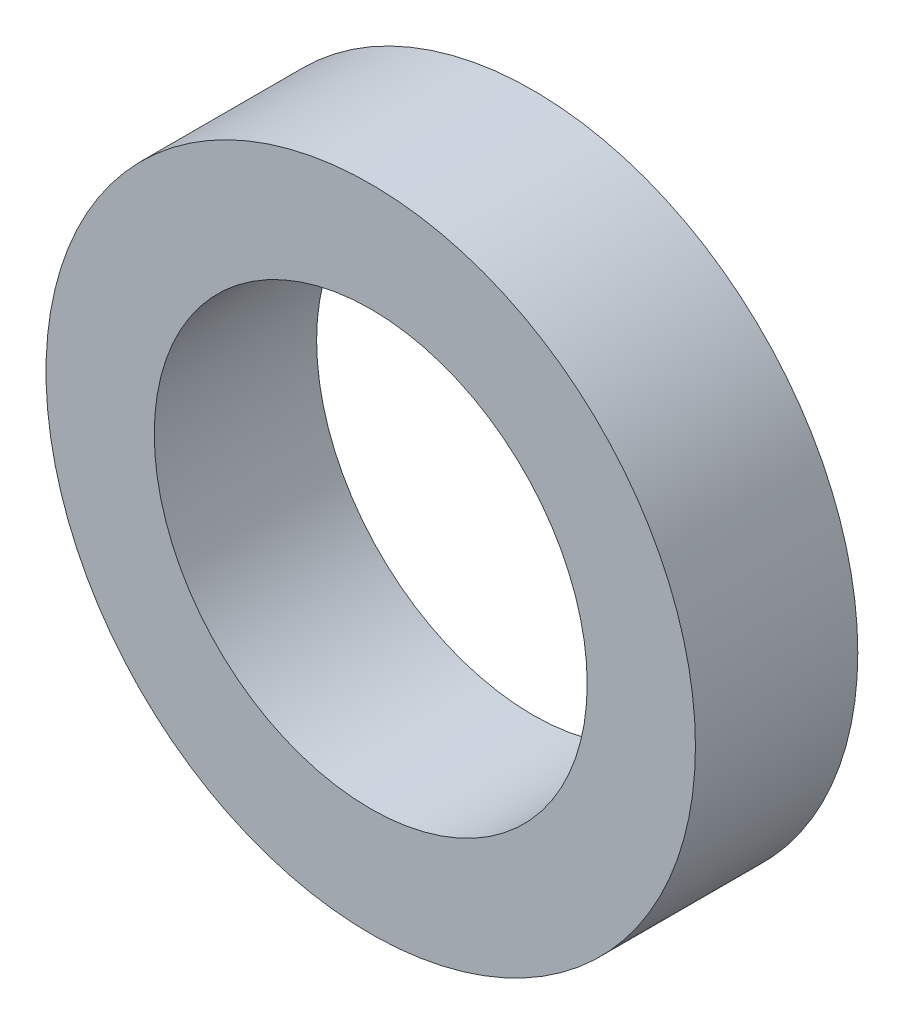
ISO-10303-21;
HEADER;
FILE_DESCRIPTION(('STEP AP214'),'2;1');
FILE_NAME('part.step','',(''),(''),'','','');
FILE_SCHEMA(('AUTOMOTIVE_DESIGN { 1 0 10303 214 1 1 1 1 }'));
ENDSEC;
DATA;
#1=APPLICATION_CONTEXT('core data for automotive mechanical design processes');
#2=APPLICATION_PROTOCOL_DEFINITION('international standard','automotive_design',2000,#1);
#3=PRODUCT_CONTEXT('',#1,'mechanical');
#4=PRODUCT('Part','Part','',(#3));
#5=PRODUCT_RELATED_PRODUCT_CATEGORY('part','',(#4));
#6=PRODUCT_DEFINITION_FORMATION('','',#4);
#7=PRODUCT_DEFINITION_CONTEXT('part definition',#1,'design');
#8=PRODUCT_DEFINITION('design','',#6,#7);
#9=PRODUCT_DEFINITION_SHAPE('','',#8);
#10=(LENGTH_UNIT() NAMED_UNIT(*) SI_UNIT(.MILLI.,.METRE.));
#11=(NAMED_UNIT(*) PLANE_ANGLE_UNIT() SI_UNIT($,.RADIAN.));
#12=(NAMED_UNIT(*) SI_UNIT($,.STERADIAN.) SOLID_ANGLE_UNIT());
#13=UNCERTAINTY_MEASURE_WITH_UNIT(LENGTH_MEASURE(1.E-05),#10,'distance_accuracy_value','');
#14=(GEOMETRIC_REPRESENTATION_CONTEXT(3) GLOBAL_UNCERTAINTY_ASSIGNED_CONTEXT((#13)) GLOBAL_UNIT_ASSIGNED_CONTEXT((#10,
#11,#12)) REPRESENTATION_CONTEXT('',''));
#15=CARTESIAN_POINT('',(0.,0.,0.));
#16=DIRECTION('',(0.,0.,1.));
#17=DIRECTION('',(1.,0.,0.));
#18=AXIS2_PLACEMENT_3D('',#15,#16,#17);
#19=CARTESIAN_POINT('',(0.,0.,3.));
#20=DIRECTION('',(0.,0.,1.));
#21=DIRECTION('',(1.,0.,0.));
#22=AXIS2_PLACEMENT_3D('',#19,#20,#21);
#23=PLANE('',#22);
#24=CARTESIAN_POINT('',(0.,0.,3.));
#25=DIRECTION('',(0.,0.,1.));
#26=DIRECTION('',(1.,0.,0.));
#27=AXIS2_PLACEMENT_3D('',#24,#25,#26);
#28=CIRCLE('',#27,6.);
#29=CARTESIAN_POINT('',(6.,0.,3.));
#30=VERTEX_POINT('',#29);
#31=EDGE_CURVE('E10',#30,#30,#28,.T.);
#32=ORIENTED_EDGE('',*,*,#31,.T.);
#33=EDGE_LOOP('',(#32));
#34=FACE_BOUND('',#33,.T.);
#35=CARTESIAN_POINT('',(0.,0.,3.));
#36=DIRECTION('',(0.,0.,1.));
#37=DIRECTION('',(1.,0.,0.));
#38=AXIS2_PLACEMENT_3D('',#35,#36,#37);
#39=CIRCLE('',#38,4.);
#40=CARTESIAN_POINT('',(4.,0.,3.));
#41=VERTEX_POINT('',#40);
#42=EDGE_CURVE('E44',#41,#41,#39,.T.);
#43=ORIENTED_EDGE('',*,*,#42,.F.);
#44=EDGE_LOOP('',(#43));
#45=FACE_BOUND('',#44,.T.);
#46=ADVANCED_FACE('F33',(#34,#45),#23,.T.);
#47=CARTESIAN_POINT('',(0.,0.,0.));
#48=DIRECTION('',(0.,0.,1.));
#49=DIRECTION('',(1.,0.,0.));
#50=AXIS2_PLACEMENT_3D('',#47,#48,#49);
#51=PLANE('',#50);
#52=CARTESIAN_POINT('',(0.,0.,0.));
#53=DIRECTION('',(0.,0.,1.));
#54=DIRECTION('',(1.,0.,0.));
#55=AXIS2_PLACEMENT_3D('',#52,#53,#54);
#56=CIRCLE('',#55,6.);
#57=CARTESIAN_POINT('',(6.,0.,0.));
#58=VERTEX_POINT('',#57);
#59=EDGE_CURVE('E37',#58,#58,#56,.T.);
#60=ORIENTED_EDGE('',*,*,#59,.F.);
#61=EDGE_LOOP('',(#60));
#62=FACE_BOUND('',#61,.T.);
#63=CARTESIAN_POINT('',(0.,0.,0.));
#64=DIRECTION('',(0.,0.,1.));
#65=DIRECTION('',(1.,0.,0.));
#66=AXIS2_PLACEMENT_3D('',#63,#64,#65);
#67=CIRCLE('',#66,4.);
#68=CARTESIAN_POINT('',(4.,0.,0.));
#69=VERTEX_POINT('',#68);
#70=EDGE_CURVE('E46',#69,#69,#67,.T.);
#71=ORIENTED_EDGE('',*,*,#70,.T.);
#72=EDGE_LOOP('',(#71));
#73=FACE_BOUND('',#72,.T.);
#74=ADVANCED_FACE('F56',(#62,#73),#51,.F.);
#75=CARTESIAN_POINT('',(0.,0.,3.));
#76=DIRECTION('',(0.,0.,-1.));
#77=DIRECTION('',(-1.,0.,0.));
#78=AXIS2_PLACEMENT_3D('',#75,#76,#77);
#79=CYLINDRICAL_SURFACE('',#78,6.);
#80=ORIENTED_EDGE('',*,*,#31,.F.);
#81=EDGE_LOOP('',(#80));
#82=FACE_BOUND('',#81,.T.);
#83=ORIENTED_EDGE('',*,*,#59,.T.);
#84=EDGE_LOOP('',(#83));
#85=FACE_BOUND('',#84,.T.);
#86=ADVANCED_FACE('F35',(#82,#85),#79,.T.);
#87=CARTESIAN_POINT('',(0.,0.,3.));
#88=DIRECTION('',(0.,0.,-1.));
#89=DIRECTION('',(-1.,0.,0.));
#90=AXIS2_PLACEMENT_3D('',#87,#88,#89);
#91=CYLINDRICAL_SURFACE('',#90,4.);
#92=ORIENTED_EDGE('',*,*,#42,.T.);
#93=EDGE_LOOP('',(#92));
#94=FACE_BOUND('',#93,.T.);
#95=ORIENTED_EDGE('',*,*,#70,.F.);
#96=EDGE_LOOP('',(#95));
#97=FACE_BOUND('',#96,.T.);
#98=ADVANCED_FACE('F52',(#94,#97),#91,.F.);
#99=CLOSED_SHELL('',(#46,#74,#86,#98));
#100=MANIFOLD_SOLID_BREP('B2',#99);
#101=ADVANCED_BREP_SHAPE_REPRESENTATION('',(#18,#100),#14);
#102=SHAPE_DEFINITION_REPRESENTATION(#9,#101);
ENDSEC;
END-ISO-10303-21;
